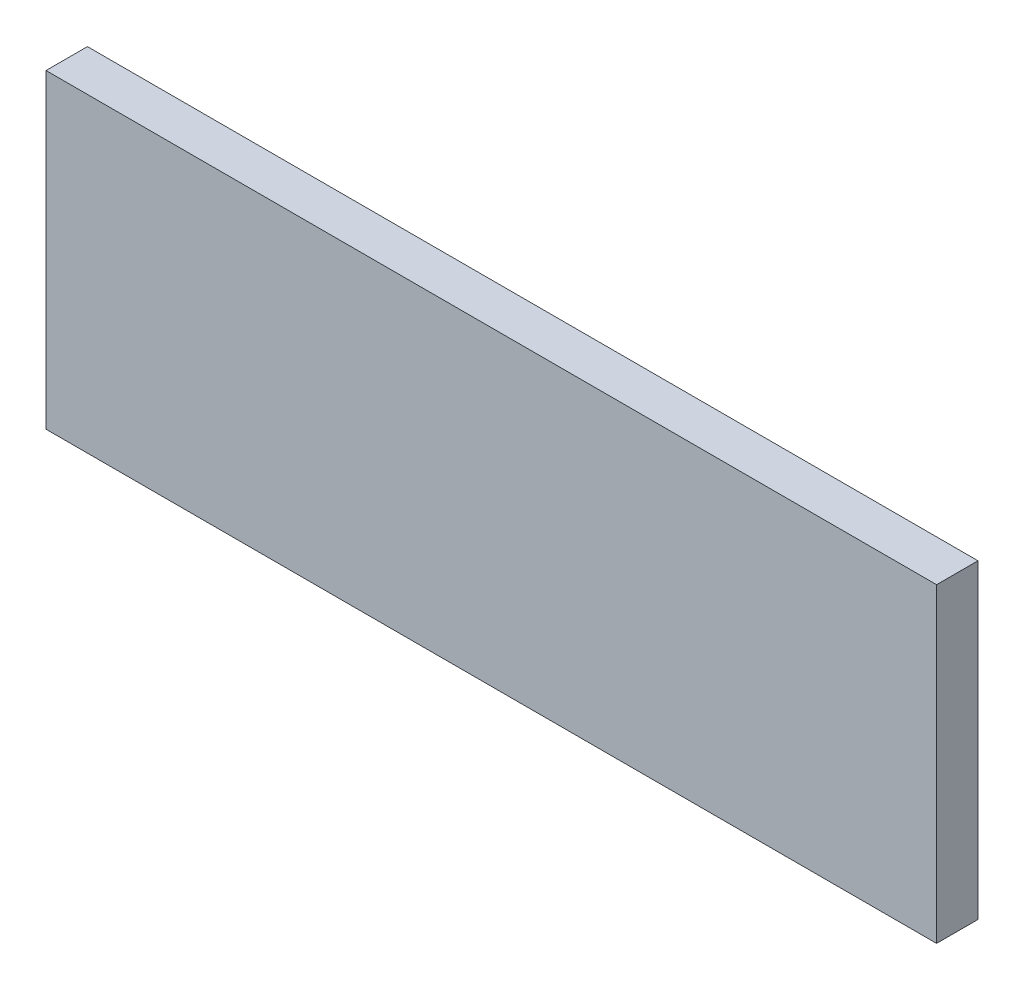
ISO-10303-21;
HEADER;
FILE_DESCRIPTION(('STEP AP214'),'2;1');
FILE_NAME('part.step','',(''),(''),'','','');
FILE_SCHEMA(('AUTOMOTIVE_DESIGN { 1 0 10303 214 1 1 1 1 }'));
ENDSEC;
DATA;
#1=APPLICATION_CONTEXT('core data for automotive mechanical design processes');
#2=APPLICATION_PROTOCOL_DEFINITION('international standard','automotive_design',2000,#1);
#3=PRODUCT_CONTEXT('',#1,'mechanical');
#4=PRODUCT('Part','Part','',(#3));
#5=PRODUCT_RELATED_PRODUCT_CATEGORY('part','',(#4));
#6=PRODUCT_DEFINITION_FORMATION('','',#4);
#7=PRODUCT_DEFINITION_CONTEXT('part definition',#1,'design');
#8=PRODUCT_DEFINITION('design','',#6,#7);
#9=PRODUCT_DEFINITION_SHAPE('','',#8);
#10=(LENGTH_UNIT() NAMED_UNIT(*) SI_UNIT(.MILLI.,.METRE.));
#11=(NAMED_UNIT(*) PLANE_ANGLE_UNIT() SI_UNIT($,.RADIAN.));
#12=(NAMED_UNIT(*) SI_UNIT($,.STERADIAN.) SOLID_ANGLE_UNIT());
#13=UNCERTAINTY_MEASURE_WITH_UNIT(LENGTH_MEASURE(1.E-05),#10,'distance_accuracy_value','');
#14=(GEOMETRIC_REPRESENTATION_CONTEXT(3) GLOBAL_UNCERTAINTY_ASSIGNED_CONTEXT((#13)) GLOBAL_UNIT_ASSIGNED_CONTEXT((#10,
#11,#12)) REPRESENTATION_CONTEXT('',''));
#15=CARTESIAN_POINT('',(0.,0.,0.));
#16=DIRECTION('',(0.,0.,1.));
#17=DIRECTION('',(1.,0.,0.));
#18=AXIS2_PLACEMENT_3D('',#15,#16,#17);
#19=CARTESIAN_POINT('',(0.,0.,5.08));
#20=DIRECTION('',(1.,0.,0.));
#21=DIRECTION('',(0.,0.,-1.));
#22=AXIS2_PLACEMENT_3D('',#19,#20,#21);
#23=PLANE('',#22);
#24=DIRECTION('',(0.,-1.,0.));
#25=VECTOR('',#24,1.);
#26=CARTESIAN_POINT('',(0.,0.,0.));
#27=LINE('',#26,#25);
#28=CARTESIAN_POINT('',(0.,38.1,0.));
#29=VERTEX_POINT('',#28);
#30=CARTESIAN_POINT('',(0.,0.,0.));
#31=VERTEX_POINT('',#30);
#32=EDGE_CURVE('E96',#29,#31,#27,.T.);
#33=ORIENTED_EDGE('',*,*,#32,.T.);
#34=DIRECTION('',(0.,0.,-1.));
#35=VECTOR('',#34,1.);
#36=CARTESIAN_POINT('',(0.,0.,5.08));
#37=LINE('',#36,#35);
#38=CARTESIAN_POINT('',(0.,0.,5.08));
#39=VERTEX_POINT('',#38);
#40=EDGE_CURVE('E11',#39,#31,#37,.T.);
#41=ORIENTED_EDGE('',*,*,#40,.F.);
#42=DIRECTION('',(0.,-1.,0.));
#43=VECTOR('',#42,1.);
#44=CARTESIAN_POINT('',(0.,0.,5.08));
#45=LINE('',#44,#43);
#46=CARTESIAN_POINT('',(0.,38.1,5.08));
#47=VERTEX_POINT('',#46);
#48=EDGE_CURVE('E84',#47,#39,#45,.T.);
#49=ORIENTED_EDGE('',*,*,#48,.F.);
#50=DIRECTION('',(0.,0.,-1.));
#51=VECTOR('',#50,1.);
#52=CARTESIAN_POINT('',(0.,38.1,5.08));
#53=LINE('',#52,#51);
#54=EDGE_CURVE('E92',#47,#29,#53,.T.);
#55=ORIENTED_EDGE('',*,*,#54,.T.);
#56=EDGE_LOOP('',(#33,#41,#49,#55));
#57=FACE_BOUND('',#56,.T.);
#58=ADVANCED_FACE('F33',(#57),#23,.F.);
#59=CARTESIAN_POINT('',(0.,0.,5.08));
#60=DIRECTION('',(0.,1.,0.));
#61=DIRECTION('',(0.,0.,1.));
#62=AXIS2_PLACEMENT_3D('',#59,#60,#61);
#63=PLANE('',#62);
#64=DIRECTION('',(1.,0.,0.));
#65=VECTOR('',#64,1.);
#66=CARTESIAN_POINT('',(0.,0.,0.));
#67=LINE('',#66,#65);
#68=CARTESIAN_POINT('',(109.22,0.,0.));
#69=VERTEX_POINT('',#68);
#70=EDGE_CURVE('E88',#31,#69,#67,.T.);
#71=ORIENTED_EDGE('',*,*,#70,.T.);
#72=DIRECTION('',(0.,0.,-1.));
#73=VECTOR('',#72,1.);
#74=CARTESIAN_POINT('',(109.22,0.,5.08));
#75=LINE('',#74,#73);
#76=CARTESIAN_POINT('',(109.22,0.,5.08));
#77=VERTEX_POINT('',#76);
#78=EDGE_CURVE('E41',#77,#69,#75,.T.);
#79=ORIENTED_EDGE('',*,*,#78,.F.);
#80=DIRECTION('',(1.,0.,0.));
#81=VECTOR('',#80,1.);
#82=CARTESIAN_POINT('',(0.,0.,5.08));
#83=LINE('',#82,#81);
#84=EDGE_CURVE('E79',#39,#77,#83,.T.);
#85=ORIENTED_EDGE('',*,*,#84,.F.);
#86=ORIENTED_EDGE('',*,*,#40,.T.);
#87=EDGE_LOOP('',(#71,#79,#85,#86));
#88=FACE_BOUND('',#87,.T.);
#89=ADVANCED_FACE('F87',(#88),#63,.F.);
#90=CARTESIAN_POINT('',(109.22,0.,5.08));
#91=DIRECTION('',(-1.,0.,0.));
#92=DIRECTION('',(0.,0.,1.));
#93=AXIS2_PLACEMENT_3D('',#90,#91,#92);
#94=PLANE('',#93);
#95=DIRECTION('',(0.,1.,0.));
#96=VECTOR('',#95,1.);
#97=CARTESIAN_POINT('',(109.22,0.,0.));
#98=LINE('',#97,#96);
#99=CARTESIAN_POINT('',(109.22,38.1,0.));
#100=VERTEX_POINT('',#99);
#101=EDGE_CURVE('E66',#69,#100,#98,.T.);
#102=ORIENTED_EDGE('',*,*,#101,.T.);
#103=DIRECTION('',(0.,0.,-1.));
#104=VECTOR('',#103,1.);
#105=CARTESIAN_POINT('',(109.22,38.1,5.08));
#106=LINE('',#105,#104);
#107=CARTESIAN_POINT('',(109.22,38.1,5.08));
#108=VERTEX_POINT('',#107);
#109=EDGE_CURVE('E89',#108,#100,#106,.T.);
#110=ORIENTED_EDGE('',*,*,#109,.F.);
#111=DIRECTION('',(0.,1.,0.));
#112=VECTOR('',#111,1.);
#113=CARTESIAN_POINT('',(109.22,0.,5.08));
#114=LINE('',#113,#112);
#115=EDGE_CURVE('E82',#77,#108,#114,.T.);
#116=ORIENTED_EDGE('',*,*,#115,.F.);
#117=ORIENTED_EDGE('',*,*,#78,.T.);
#118=EDGE_LOOP('',(#102,#110,#116,#117));
#119=FACE_BOUND('',#118,.T.);
#120=ADVANCED_FACE('F90',(#119),#94,.F.);
#121=CARTESIAN_POINT('',(0.,38.1,5.08));
#122=DIRECTION('',(0.,-1.,0.));
#123=DIRECTION('',(0.,0.,-1.));
#124=AXIS2_PLACEMENT_3D('',#121,#122,#123);
#125=PLANE('',#124);
#126=DIRECTION('',(-1.,0.,0.));
#127=VECTOR('',#126,1.);
#128=CARTESIAN_POINT('',(0.,38.1,0.));
#129=LINE('',#128,#127);
#130=EDGE_CURVE('E72',#100,#29,#129,.T.);
#131=ORIENTED_EDGE('',*,*,#130,.T.);
#132=ORIENTED_EDGE('',*,*,#54,.F.);
#133=DIRECTION('',(-1.,0.,0.));
#134=VECTOR('',#133,1.);
#135=CARTESIAN_POINT('',(0.,38.1,5.08));
#136=LINE('',#135,#134);
#137=EDGE_CURVE('E49',#108,#47,#136,.T.);
#138=ORIENTED_EDGE('',*,*,#137,.F.);
#139=ORIENTED_EDGE('',*,*,#109,.T.);
#140=EDGE_LOOP('',(#131,#132,#138,#139));
#141=FACE_BOUND('',#140,.T.);
#142=ADVANCED_FACE('F103',(#141),#125,.F.);
#143=CARTESIAN_POINT('',(0.,0.,5.08));
#144=DIRECTION('',(0.,0.,-1.));
#145=DIRECTION('',(-1.,0.,0.));
#146=AXIS2_PLACEMENT_3D('',#143,#144,#145);
#147=PLANE('',#146);
#148=ORIENTED_EDGE('',*,*,#48,.T.);
#149=ORIENTED_EDGE('',*,*,#84,.T.);
#150=ORIENTED_EDGE('',*,*,#115,.T.);
#151=ORIENTED_EDGE('',*,*,#137,.T.);
#152=EDGE_LOOP('',(#148,#149,#150,#151));
#153=FACE_BOUND('',#152,.T.);
#154=ADVANCED_FACE('F80',(#153),#147,.F.);
#155=CARTESIAN_POINT('',(0.,0.,0.));
#156=DIRECTION('',(0.,0.,-1.));
#157=DIRECTION('',(-1.,0.,0.));
#158=AXIS2_PLACEMENT_3D('',#155,#156,#157);
#159=PLANE('',#158);
#160=ORIENTED_EDGE('',*,*,#32,.F.);
#161=ORIENTED_EDGE('',*,*,#130,.F.);
#162=ORIENTED_EDGE('',*,*,#101,.F.);
#163=ORIENTED_EDGE('',*,*,#70,.F.);
#164=EDGE_LOOP('',(#160,#161,#162,#163));
#165=FACE_BOUND('',#164,.T.);
#166=ADVANCED_FACE('F106',(#165),#159,.T.);
#167=CLOSED_SHELL('',(#58,#89,#120,#142,#154,#166));
#168=MANIFOLD_SOLID_BREP('B2',#167);
#169=ADVANCED_BREP_SHAPE_REPRESENTATION('',(#18,#168),#14);
#170=SHAPE_DEFINITION_REPRESENTATION(#9,#169);
ENDSEC;
END-ISO-10303-21;
